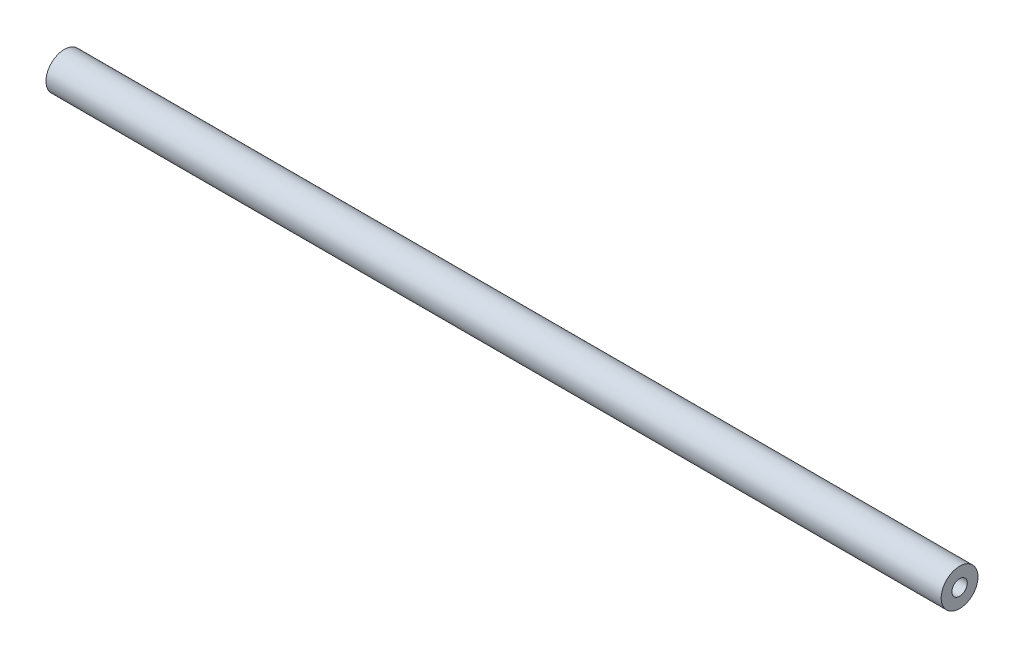
ISO-10303-21;
HEADER;
FILE_DESCRIPTION(('STEP AP214'),'2;1');
FILE_NAME('part.step','',(''),(''),'','','');
FILE_SCHEMA(('AUTOMOTIVE_DESIGN { 1 0 10303 214 1 1 1 1 }'));
ENDSEC;
DATA;
#1=APPLICATION_CONTEXT('core data for automotive mechanical design processes');
#2=APPLICATION_PROTOCOL_DEFINITION('international standard','automotive_design',2000,#1);
#3=PRODUCT_CONTEXT('',#1,'mechanical');
#4=PRODUCT('Part','Part','',(#3));
#5=PRODUCT_RELATED_PRODUCT_CATEGORY('part','',(#4));
#6=PRODUCT_DEFINITION_FORMATION('','',#4);
#7=PRODUCT_DEFINITION_CONTEXT('part definition',#1,'design');
#8=PRODUCT_DEFINITION('design','',#6,#7);
#9=PRODUCT_DEFINITION_SHAPE('','',#8);
#10=(LENGTH_UNIT() NAMED_UNIT(*) SI_UNIT(.MILLI.,.METRE.));
#11=(NAMED_UNIT(*) PLANE_ANGLE_UNIT() SI_UNIT($,.RADIAN.));
#12=(NAMED_UNIT(*) SI_UNIT($,.STERADIAN.) SOLID_ANGLE_UNIT());
#13=UNCERTAINTY_MEASURE_WITH_UNIT(LENGTH_MEASURE(1.E-05),#10,'distance_accuracy_value','');
#14=(GEOMETRIC_REPRESENTATION_CONTEXT(3) GLOBAL_UNCERTAINTY_ASSIGNED_CONTEXT((#13)) GLOBAL_UNIT_ASSIGNED_CONTEXT((#10,
#11,#12)) REPRESENTATION_CONTEXT('',''));
#15=CARTESIAN_POINT('',(0.,0.,0.));
#16=DIRECTION('',(0.,0.,1.));
#17=DIRECTION('',(1.,0.,0.));
#18=AXIS2_PLACEMENT_3D('',#15,#16,#17);
#19=CARTESIAN_POINT('',(231.7115,0.,0.));
#20=DIRECTION('',(1.,0.,0.));
#21=DIRECTION('',(0.,0.,-1.));
#22=AXIS2_PLACEMENT_3D('',#19,#20,#21);
#23=PLANE('',#22);
#24=CARTESIAN_POINT('',(231.7115,0.,0.));
#25=DIRECTION('',(1.,0.,0.));
#26=DIRECTION('',(0.,0.,-1.));
#27=AXIS2_PLACEMENT_3D('',#24,#25,#26);
#28=CIRCLE('',#27,9.525);
#29=CARTESIAN_POINT('',(231.7115,0.,-9.525));
#30=VERTEX_POINT('',#29);
#31=EDGE_CURVE('E10',#30,#30,#28,.T.);
#32=ORIENTED_EDGE('',*,*,#31,.T.);
#33=EDGE_LOOP('',(#32));
#34=FACE_BOUND('',#33,.T.);
#35=CARTESIAN_POINT('',(231.7115,0.,0.));
#36=DIRECTION('',(1.,0.,0.));
#37=DIRECTION('',(0.,0.,-1.));
#38=AXIS2_PLACEMENT_3D('',#35,#36,#37);
#39=CIRCLE('',#38,3.96875);
#40=CARTESIAN_POINT('',(231.7115,0.,-3.96875));
#41=VERTEX_POINT('',#40);
#42=EDGE_CURVE('E42',#41,#41,#39,.T.);
#43=ORIENTED_EDGE('',*,*,#42,.F.);
#44=EDGE_LOOP('',(#43));
#45=FACE_BOUND('',#44,.T.);
#46=ADVANCED_FACE('F31',(#34,#45),#23,.T.);
#47=CARTESIAN_POINT('',(-231.7115,0.,0.));
#48=DIRECTION('',(1.,0.,0.));
#49=DIRECTION('',(0.,0.,-1.));
#50=AXIS2_PLACEMENT_3D('',#47,#48,#49);
#51=PLANE('',#50);
#52=CARTESIAN_POINT('',(-231.7115,0.,0.));
#53=DIRECTION('',(1.,0.,0.));
#54=DIRECTION('',(0.,0.,-1.));
#55=AXIS2_PLACEMENT_3D('',#52,#53,#54);
#56=CIRCLE('',#55,9.525);
#57=CARTESIAN_POINT('',(-231.7115,0.,-9.525));
#58=VERTEX_POINT('',#57);
#59=EDGE_CURVE('E35',#58,#58,#56,.T.);
#60=ORIENTED_EDGE('',*,*,#59,.F.);
#61=EDGE_LOOP('',(#60));
#62=FACE_BOUND('',#61,.T.);
#63=CARTESIAN_POINT('',(-231.7115,0.,0.));
#64=DIRECTION('',(1.,0.,0.));
#65=DIRECTION('',(0.,0.,-1.));
#66=AXIS2_PLACEMENT_3D('',#63,#64,#65);
#67=CIRCLE('',#66,3.96875);
#68=CARTESIAN_POINT('',(-231.7115,0.,-3.96875));
#69=VERTEX_POINT('',#68);
#70=EDGE_CURVE('E44',#69,#69,#67,.T.);
#71=ORIENTED_EDGE('',*,*,#70,.T.);
#72=EDGE_LOOP('',(#71));
#73=FACE_BOUND('',#72,.T.);
#74=ADVANCED_FACE('F54',(#62,#73),#51,.F.);
#75=CARTESIAN_POINT('',(231.7115,0.,0.));
#76=DIRECTION('',(-1.,0.,0.));
#77=DIRECTION('',(0.,0.,1.));
#78=AXIS2_PLACEMENT_3D('',#75,#76,#77);
#79=CYLINDRICAL_SURFACE('',#78,9.525);
#80=ORIENTED_EDGE('',*,*,#31,.F.);
#81=EDGE_LOOP('',(#80));
#82=FACE_BOUND('',#81,.T.);
#83=ORIENTED_EDGE('',*,*,#59,.T.);
#84=EDGE_LOOP('',(#83));
#85=FACE_BOUND('',#84,.T.);
#86=ADVANCED_FACE('F33',(#82,#85),#79,.T.);
#87=CARTESIAN_POINT('',(231.7115,0.,0.));
#88=DIRECTION('',(-1.,0.,0.));
#89=DIRECTION('',(0.,0.,1.));
#90=AXIS2_PLACEMENT_3D('',#87,#88,#89);
#91=CYLINDRICAL_SURFACE('',#90,3.96875);
#92=ORIENTED_EDGE('',*,*,#42,.T.);
#93=EDGE_LOOP('',(#92));
#94=FACE_BOUND('',#93,.T.);
#95=ORIENTED_EDGE('',*,*,#70,.F.);
#96=EDGE_LOOP('',(#95));
#97=FACE_BOUND('',#96,.T.);
#98=ADVANCED_FACE('F50',(#94,#97),#91,.F.);
#99=CLOSED_SHELL('',(#46,#74,#86,#98));
#100=MANIFOLD_SOLID_BREP('B2',#99);
#101=ADVANCED_BREP_SHAPE_REPRESENTATION('',(#18,#100),#14);
#102=SHAPE_DEFINITION_REPRESENTATION(#9,#101);
ENDSEC;
END-ISO-10303-21;
